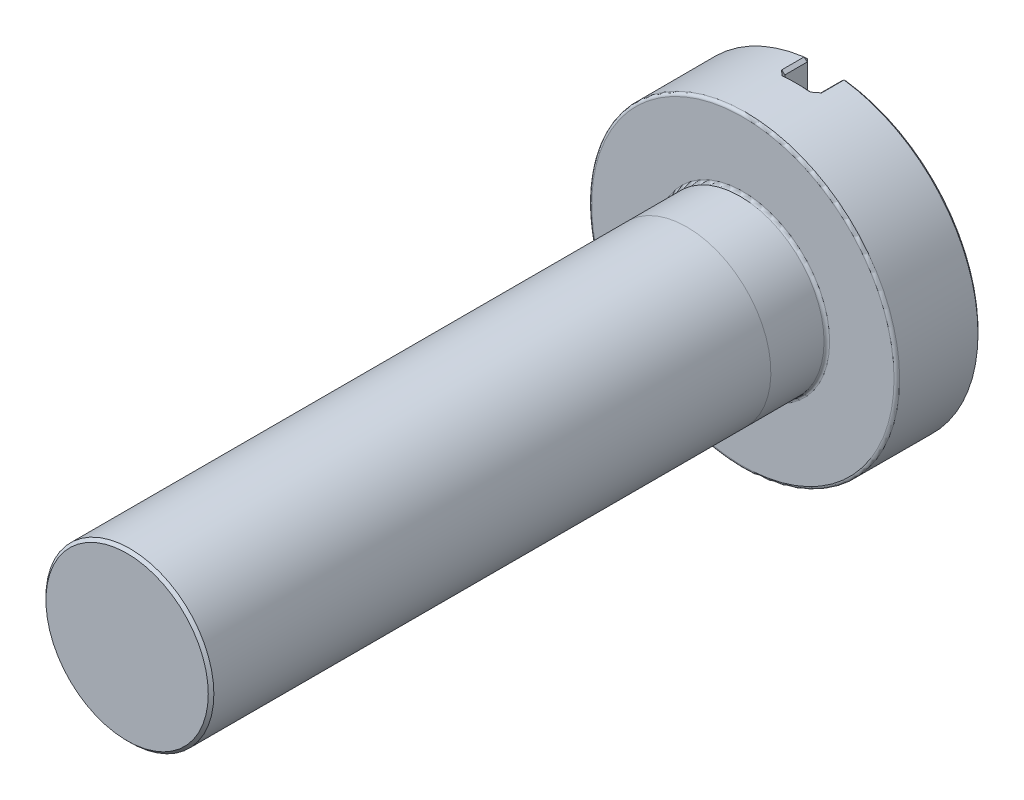
ISO-10303-21;
HEADER;
FILE_DESCRIPTION(('STEP AP214'),'2;1');
FILE_NAME('part.step','',(''),(''),'','','');
FILE_SCHEMA(('AUTOMOTIVE_DESIGN { 1 0 10303 214 1 1 1 1 }'));
ENDSEC;
DATA;
#1=APPLICATION_CONTEXT('core data for automotive mechanical design processes');
#2=APPLICATION_PROTOCOL_DEFINITION('international standard','automotive_design',2000,#1);
#3=PRODUCT_CONTEXT('',#1,'mechanical');
#4=PRODUCT('Part','Part','',(#3));
#5=PRODUCT_RELATED_PRODUCT_CATEGORY('part','',(#4));
#6=PRODUCT_DEFINITION_FORMATION('','',#4);
#7=PRODUCT_DEFINITION_CONTEXT('part definition',#1,'design');
#8=PRODUCT_DEFINITION('design','',#6,#7);
#9=PRODUCT_DEFINITION_SHAPE('','',#8);
#10=(LENGTH_UNIT() NAMED_UNIT(*) SI_UNIT(.MILLI.,.METRE.));
#11=(NAMED_UNIT(*) PLANE_ANGLE_UNIT() SI_UNIT($,.RADIAN.));
#12=(NAMED_UNIT(*) SI_UNIT($,.STERADIAN.) SOLID_ANGLE_UNIT());
#13=UNCERTAINTY_MEASURE_WITH_UNIT(LENGTH_MEASURE(1.E-05),#10,'distance_accuracy_value','');
#14=(GEOMETRIC_REPRESENTATION_CONTEXT(3) GLOBAL_UNCERTAINTY_ASSIGNED_CONTEXT((#13)) GLOBAL_UNIT_ASSIGNED_CONTEXT((#10,
#11,#12)) REPRESENTATION_CONTEXT('',''));
#15=CARTESIAN_POINT('',(0.,0.,0.));
#16=DIRECTION('',(0.,0.,1.));
#17=DIRECTION('',(1.,0.,0.));
#18=AXIS2_PLACEMENT_3D('',#15,#16,#17);
#19=CARTESIAN_POINT('',(0.,0.,11.));
#20=DIRECTION('',(0.,0.,-1.));
#21=DIRECTION('',(-1.,0.,0.));
#22=AXIS2_PLACEMENT_3D('',#19,#20,#21);
#23=CYLINDRICAL_SURFACE('',#22,1.5);
#24=CARTESIAN_POINT('',(0.,0.,10.95));
#25=DIRECTION('',(0.,0.,1.));
#26=DIRECTION('',(1.,0.,0.));
#27=AXIS2_PLACEMENT_3D('',#24,#25,#26);
#28=CIRCLE('',#27,1.5);
#29=CARTESIAN_POINT('',(1.5,0.,10.95));
#30=VERTEX_POINT('',#29);
#31=EDGE_CURVE('E46',#30,#30,#28,.F.);
#32=ORIENTED_EDGE('',*,*,#31,.T.);
#33=EDGE_LOOP('',(#32));
#34=FACE_BOUND('',#33,.T.);
#35=CARTESIAN_POINT('',(0.,0.,0.999999999999999));
#36=DIRECTION('',(0.,0.,-1.));
#37=DIRECTION('',(0.,1.,0.));
#38=AXIS2_PLACEMENT_3D('',#35,#36,#37);
#39=CIRCLE('',#38,1.5);
#40=CARTESIAN_POINT('',(0.,1.5,0.999999999999999));
#41=VERTEX_POINT('',#40);
#42=EDGE_CURVE('E11',#41,#41,#39,.T.);
#43=ORIENTED_EDGE('',*,*,#42,.F.);
#44=EDGE_LOOP('',(#43));
#45=FACE_BOUND('',#44,.T.);
#46=ADVANCED_FACE('F37',(#34,#45),#23,.T.);
#47=CARTESIAN_POINT('',(0.,0.,-1.5));
#48=DIRECTION('',(0.,0.,1.));
#49=DIRECTION('',(1.,0.,0.));
#50=AXIS2_PLACEMENT_3D('',#47,#48,#49);
#51=CYLINDRICAL_SURFACE('',#50,2.75);
#52=CARTESIAN_POINT('',(0.,0.,-0.0499999999999999));
#53=DIRECTION('',(0.,0.,1.));
#54=DIRECTION('',(1.,0.,0.));
#55=AXIS2_PLACEMENT_3D('',#52,#53,#54);
#56=CIRCLE('',#55,2.75);
#57=CARTESIAN_POINT('',(2.75,0.,-0.0499999999999999));
#58=VERTEX_POINT('',#57);
#59=EDGE_CURVE('E461',#58,#58,#56,.F.);
#60=ORIENTED_EDGE('',*,*,#59,.T.);
#61=EDGE_LOOP('',(#60));
#62=FACE_BOUND('',#61,.T.);
#63=CARTESIAN_POINT('',(-0.356481481481481,2.72679683023154,-1.05));
#64=CARTESIAN_POINT('',(-0.347664395842464,2.72794946380014,-1.04117807206455));
#65=CARTESIAN_POINT('',(-0.33882512364023,2.7290615860206,-1.03237298581949));
#66=CARTESIAN_POINT('',(-0.321099028338335,2.73120398569253,-1.01480079977808));
#67=CARTESIAN_POINT('',(-0.312212205212935,2.73223426309969,-1.0060337000023));
#68=CARTESIAN_POINT('',(-0.287162841256095,2.73501387422917,-0.981451563587695));
#69=CARTESIAN_POINT('',(-0.270942516358507,2.73666902458201,-0.965684718089823));
#70=CARTESIAN_POINT('',(-0.254629629631047,2.7381862156752,-0.950000000001396));
#71=B_SPLINE_CURVE_WITH_KNOTS('',3,(#63,#64,#65,#66,#67,#68,#69,#70),.UNSPECIFIED.,.F.,.F.,(4,2,
2,4),(0.,0.0375773794297736,0.0751547792021277,0.1431957218944),.UNSPECIFIED.);
#72=CARTESIAN_POINT('',(-0.356481481481481,2.72679683023154,-1.05));
#73=VERTEX_POINT('',#72);
#74=CARTESIAN_POINT('',(-0.254629629629628,2.73818621567538,-0.95));
#75=VERTEX_POINT('',#74);
#76=EDGE_CURVE('E250',#73,#75,#71,.T.);
#77=ORIENTED_EDGE('',*,*,#76,.F.);
#78=DIRECTION('',(0.,0.,1.));
#79=VECTOR('',#78,1.);
#80=CARTESIAN_POINT('',(-0.356481481481481,2.72679683023154,-1.5));
#81=LINE('',#80,#79);
#82=CARTESIAN_POINT('',(-0.356481481481481,2.72679683023154,-1.45));
#83=VERTEX_POINT('',#82);
#84=EDGE_CURVE('E248',#73,#83,#81,.F.);
#85=ORIENTED_EDGE('',*,*,#84,.T.);
#86=CARTESIAN_POINT('',(0.,0.,-1.45));
#87=DIRECTION('',(0.,0.,1.));
#88=DIRECTION('',(1.,0.,0.));
#89=AXIS2_PLACEMENT_3D('',#86,#87,#88);
#90=CIRCLE('',#89,2.75);
#91=CARTESIAN_POINT('',(-0.356481481481482,-2.72679683023154,-1.45));
#92=VERTEX_POINT('',#91);
#93=EDGE_CURVE('E243',#83,#92,#90,.T.);
#94=ORIENTED_EDGE('',*,*,#93,.T.);
#95=DIRECTION('',(0.,0.,1.));
#96=VECTOR('',#95,1.);
#97=CARTESIAN_POINT('',(-0.356481481481482,-2.72679683023154,-1.5));
#98=LINE('',#97,#96);
#99=CARTESIAN_POINT('',(-0.356481481481482,-2.72679683023154,-1.05));
#100=VERTEX_POINT('',#99);
#101=EDGE_CURVE('E241',#92,#100,#98,.T.);
#102=ORIENTED_EDGE('',*,*,#101,.T.);
#103=CARTESIAN_POINT('',(-0.254629629629629,-2.73818621567538,-0.95));
#104=CARTESIAN_POINT('',(-0.263638943794522,-2.73734837041018,-0.958661912495163));
#105=CARTESIAN_POINT('',(-0.272619899169563,-2.73646840241964,-0.967349125297718));
#106=CARTESIAN_POINT('',(-0.290528422567072,-2.73462508679492,-0.984769605017457));
#107=CARTESIAN_POINT('',(-0.299455990634111,-2.73366173923036,-0.993502871896181));
#108=CARTESIAN_POINT('',(-0.32447825011662,-2.73083811004549,-1.01810769091684));
#109=CARTESIAN_POINT('',(-0.340515929031501,-2.728883819563,-1.034026548804));
#110=CARTESIAN_POINT('',(-0.356481481481482,-2.72679683023154,-1.05));
#111=B_SPLINE_CURVE_WITH_KNOTS('',3,(#103,#104,#105,#106,#107,#108,#109,#110),.UNSPECIFIED.,.F.,
.F.,(4,2,2,4),(0.,0.0375774596881582,0.0751548880003334,0.14319579112404),.UNSPECIFIED.);
#112=CARTESIAN_POINT('',(-0.254629629629629,-2.73818621567538,-0.95));
#113=VERTEX_POINT('',#112);
#114=EDGE_CURVE('E234',#113,#100,#111,.T.);
#115=ORIENTED_EDGE('',*,*,#114,.F.);
#116=CARTESIAN_POINT('',(0.,0.,-0.95));
#117=DIRECTION('',(0.,0.,-1.));
#118=DIRECTION('',(-1.,0.,0.));
#119=AXIS2_PLACEMENT_3D('',#116,#117,#118);
#120=CIRCLE('',#119,2.75);
#121=CARTESIAN_POINT('',(0.254629629629627,-2.73818621567538,-0.95));
#122=VERTEX_POINT('',#121);
#123=EDGE_CURVE('E197',#113,#122,#120,.F.);
#124=ORIENTED_EDGE('',*,*,#123,.T.);
#125=CARTESIAN_POINT('',(0.356481481481481,-2.72679683023154,-1.05));
#126=CARTESIAN_POINT('',(0.347664395842463,-2.72794946380014,-1.04117807206455));
#127=CARTESIAN_POINT('',(0.338825123640229,-2.7290615860206,-1.03237298581949));
#128=CARTESIAN_POINT('',(0.321099028338334,-2.73120398569253,-1.01480079977808));
#129=CARTESIAN_POINT('',(0.312212205212934,-2.73223426309969,-1.0060337000023));
#130=CARTESIAN_POINT('',(0.287162841256095,-2.73501387422917,-0.981451563587695));
#131=CARTESIAN_POINT('',(0.270942516358507,-2.73666902458202,-0.965684718089822));
#132=CARTESIAN_POINT('',(0.254629629631046,-2.7381862156752,-0.950000000001396));
#133=B_SPLINE_CURVE_WITH_KNOTS('',3,(#125,#126,#127,#128,#129,#130,#131,#132),.UNSPECIFIED.,.F.,
.F.,(4,2,2,4),(0.,0.0375773794297739,0.0751547792021283,0.1431957218944),.UNSPECIFIED.);
#134=CARTESIAN_POINT('',(0.356481481481481,-2.72679683023154,-1.05));
#135=VERTEX_POINT('',#134);
#136=EDGE_CURVE('E188',#135,#122,#133,.T.);
#137=ORIENTED_EDGE('',*,*,#136,.F.);
#138=DIRECTION('',(0.,0.,1.));
#139=VECTOR('',#138,1.);
#140=CARTESIAN_POINT('',(0.35648148148148,-2.72679683023154,-1.5));
#141=LINE('',#140,#139);
#142=CARTESIAN_POINT('',(0.356481481481481,-2.72679683023154,-1.45));
#143=VERTEX_POINT('',#142);
#144=EDGE_CURVE('E186',#135,#143,#141,.F.);
#145=ORIENTED_EDGE('',*,*,#144,.T.);
#146=CARTESIAN_POINT('',(0.,0.,-1.45));
#147=DIRECTION('',(0.,0.,1.));
#148=DIRECTION('',(1.,0.,0.));
#149=AXIS2_PLACEMENT_3D('',#146,#147,#148);
#150=CIRCLE('',#149,2.75);
#151=CARTESIAN_POINT('',(0.356481481481483,2.72679683023154,-1.45));
#152=VERTEX_POINT('',#151);
#153=EDGE_CURVE('E182',#143,#152,#150,.T.);
#154=ORIENTED_EDGE('',*,*,#153,.T.);
#155=DIRECTION('',(0.,0.,1.));
#156=VECTOR('',#155,1.);
#157=CARTESIAN_POINT('',(0.356481481481483,2.72679683023154,-1.5));
#158=LINE('',#157,#156);
#159=CARTESIAN_POINT('',(0.356481481481483,2.72679683023154,-1.05));
#160=VERTEX_POINT('',#159);
#161=EDGE_CURVE('E184',#152,#160,#158,.T.);
#162=ORIENTED_EDGE('',*,*,#161,.T.);
#163=CARTESIAN_POINT('',(0.254629629629628,2.73818621567538,-0.95));
#164=CARTESIAN_POINT('',(0.263638943794522,2.73734837041018,-0.958661912495163));
#165=CARTESIAN_POINT('',(0.272619899169562,2.73646840241964,-0.967349125297718));
#166=CARTESIAN_POINT('',(0.290528422567072,2.73462508679492,-0.984769605017457));
#167=CARTESIAN_POINT('',(0.299455990634111,2.73366173923036,-0.99350287189618));
#168=CARTESIAN_POINT('',(0.32447825011662,2.73083811004549,-1.01810769091684));
#169=CARTESIAN_POINT('',(0.340515929031501,2.72888381956299,-1.034026548804));
#170=CARTESIAN_POINT('',(0.356481481481483,2.72679683023154,-1.05));
#171=B_SPLINE_CURVE_WITH_KNOTS('',3,(#163,#164,#165,#166,#167,#168,#169,#170),.UNSPECIFIED.,.F.,
.F.,(4,2,2,4),(0.,0.0375774596881585,0.075154888000334,0.143195791124041),.UNSPECIFIED.);
#172=CARTESIAN_POINT('',(0.254629629629628,2.73818621567538,-0.95));
#173=VERTEX_POINT('',#172);
#174=EDGE_CURVE('E227',#173,#160,#171,.T.);
#175=ORIENTED_EDGE('',*,*,#174,.F.);
#176=CARTESIAN_POINT('',(0.,0.,-0.95));
#177=DIRECTION('',(0.,0.,-1.));
#178=DIRECTION('',(-1.,0.,0.));
#179=AXIS2_PLACEMENT_3D('',#176,#177,#178);
#180=CIRCLE('',#179,2.75);
#181=EDGE_CURVE('E246',#173,#75,#180,.F.);
#182=ORIENTED_EDGE('',*,*,#181,.T.);
#183=EDGE_LOOP('',(#77,#85,#94,#102,#115,#124,#137,#145,#154,#162,#175,#182));
#184=FACE_BOUND('',#183,.T.);
#185=ADVANCED_FACE('F199',(#62,#184),#51,.T.);
#186=CARTESIAN_POINT('',(0.,0.,-1.5));
#187=DIRECTION('',(0.,0.,1.));
#188=DIRECTION('',(1.,0.,0.));
#189=AXIS2_PLACEMENT_3D('',#186,#187,#188);
#190=PLANE('',#189);
#191=CARTESIAN_POINT('',(0.,0.,-1.5));
#192=DIRECTION('',(0.,0.,1.));
#193=DIRECTION('',(1.,0.,0.));
#194=AXIS2_PLACEMENT_3D('',#191,#192,#193);
#195=CIRCLE('',#194,2.7);
#196=CARTESIAN_POINT('',(-0.350000000000001,-2.67721870604551,-1.5));
#197=VERTEX_POINT('',#196);
#198=CARTESIAN_POINT('',(-0.35,2.67721870604551,-1.5));
#199=VERTEX_POINT('',#198);
#200=EDGE_CURVE('E165',#197,#199,#195,.F.);
#201=ORIENTED_EDGE('',*,*,#200,.T.);
#202=DIRECTION('',(0.,-1.,0.));
#203=VECTOR('',#202,1.);
#204=CARTESIAN_POINT('',(-0.35,0.,-1.5));
#205=LINE('',#204,#203);
#206=EDGE_CURVE('E147',#199,#197,#205,.T.);
#207=ORIENTED_EDGE('',*,*,#206,.T.);
#208=EDGE_LOOP('',(#201,#207));
#209=FACE_BOUND('',#208,.T.);
#210=ADVANCED_FACE('F172',(#209),#190,.F.);
#211=ORIENTED_EDGE('',*,*,#42,.T.);
#212=EDGE_LOOP('',(#211));
#213=FACE_BOUND('',#212,.T.);
#214=CARTESIAN_POINT('',(0.,0.,0.0499999999999997));
#215=DIRECTION('',(0.,0.,1.));
#216=DIRECTION('',(1.,0.,0.));
#217=AXIS2_PLACEMENT_3D('',#214,#215,#216);
#218=CIRCLE('',#217,1.5);
#219=CARTESIAN_POINT('',(1.5,0.,0.0499999999999997));
#220=VERTEX_POINT('',#219);
#221=EDGE_CURVE('E459',#220,#220,#218,.T.);
#222=ORIENTED_EDGE('',*,*,#221,.T.);
#223=EDGE_LOOP('',(#222));
#224=FACE_BOUND('',#223,.T.);
#225=ADVANCED_FACE('F208',(#213,#224),#23,.T.);
#226=CARTESIAN_POINT('',(0.,0.,11.));
#227=DIRECTION('',(0.,0.,1.));
#228=DIRECTION('',(1.,0.,0.));
#229=AXIS2_PLACEMENT_3D('',#226,#227,#228);
#230=PLANE('',#229);
#231=CARTESIAN_POINT('',(0.,0.,11.));
#232=DIRECTION('',(0.,0.,1.));
#233=DIRECTION('',(1.,0.,0.));
#234=AXIS2_PLACEMENT_3D('',#231,#232,#233);
#235=CIRCLE('',#234,1.45);
#236=CARTESIAN_POINT('',(1.45,0.,11.));
#237=VERTEX_POINT('',#236);
#238=EDGE_CURVE('E460',#237,#237,#235,.T.);
#239=ORIENTED_EDGE('',*,*,#238,.T.);
#240=EDGE_LOOP('',(#239));
#241=FACE_BOUND('',#240,.T.);
#242=ADVANCED_FACE('F446',(#241),#230,.T.);
#243=CARTESIAN_POINT('',(0.,0.,-1.5));
#244=DIRECTION('',(0.,0.,1.));
#245=DIRECTION('',(1.,0.,0.));
#246=AXIS2_PLACEMENT_3D('',#243,#244,#245);
#247=CIRCLE('',#246,2.7);
#248=CARTESIAN_POINT('',(0.35,2.67721870604551,-1.5));
#249=VERTEX_POINT('',#248);
#250=CARTESIAN_POINT('',(0.349999999999999,-2.67721870604551,-1.5));
#251=VERTEX_POINT('',#250);
#252=EDGE_CURVE('E52',#249,#251,#247,.F.);
#253=ORIENTED_EDGE('',*,*,#252,.T.);
#254=DIRECTION('',(0.,1.,0.));
#255=VECTOR('',#254,1.);
#256=CARTESIAN_POINT('',(0.35,0.,-1.5));
#257=LINE('',#256,#255);
#258=EDGE_CURVE('E477',#251,#249,#257,.T.);
#259=ORIENTED_EDGE('',*,*,#258,.T.);
#260=EDGE_LOOP('',(#253,#259));
#261=FACE_BOUND('',#260,.T.);
#262=ADVANCED_FACE('F452',(#261),#190,.F.);
#263=CARTESIAN_POINT('',(0.,0.,0.));
#264=DIRECTION('',(0.,0.,1.));
#265=DIRECTION('',(1.,0.,0.));
#266=AXIS2_PLACEMENT_3D('',#263,#264,#265);
#267=PLANE('',#266);
#268=CARTESIAN_POINT('',(0.,0.,0.));
#269=DIRECTION('',(0.,0.,1.));
#270=DIRECTION('',(1.,0.,0.));
#271=AXIS2_PLACEMENT_3D('',#268,#269,#270);
#272=CIRCLE('',#271,2.7);
#273=CARTESIAN_POINT('',(2.7,0.,0.));
#274=VERTEX_POINT('',#273);
#275=EDGE_CURVE('E466',#274,#274,#272,.T.);
#276=ORIENTED_EDGE('',*,*,#275,.T.);
#277=EDGE_LOOP('',(#276));
#278=FACE_BOUND('',#277,.T.);
#279=CARTESIAN_POINT('',(0.,0.,0.));
#280=DIRECTION('',(0.,0.,1.));
#281=DIRECTION('',(1.,0.,0.));
#282=AXIS2_PLACEMENT_3D('',#279,#280,#281);
#283=CIRCLE('',#282,1.55);
#284=CARTESIAN_POINT('',(1.55,0.,0.));
#285=VERTEX_POINT('',#284);
#286=EDGE_CURVE('E474',#285,#285,#283,.F.);
#287=ORIENTED_EDGE('',*,*,#286,.T.);
#288=EDGE_LOOP('',(#287));
#289=FACE_BOUND('',#288,.T.);
#290=ADVANCED_FACE('F604',(#278,#289),#267,.T.);
#291=CARTESIAN_POINT('',(-0.299999999999999,11.0409396780184,-1.));
#292=DIRECTION('',(-1.,0.,0.));
#293=DIRECTION('',(0.,-1.,0.));
#294=AXIS2_PLACEMENT_3D('',#291,#292,#293);
#295=PLANE('',#294);
#296=DIRECTION('',(0.,0.,-1.));
#297=VECTOR('',#296,1.);
#298=CARTESIAN_POINT('',(-0.300000000000001,-2.67721870604551,-1.5));
#299=LINE('',#298,#297);
#300=CARTESIAN_POINT('',(-0.300000000000001,-2.67721870604551,-1.05));
#301=VERTEX_POINT('',#300);
#302=CARTESIAN_POINT('',(-0.300000000000001,-2.67721870604551,-1.45));
#303=VERTEX_POINT('',#302);
#304=EDGE_CURVE('E179',#301,#303,#299,.T.);
#305=ORIENTED_EDGE('',*,*,#304,.T.);
#306=DIRECTION('',(0.,1.,0.));
#307=VECTOR('',#306,1.);
#308=CARTESIAN_POINT('',(-0.299999999999999,11.0409396780184,-1.45));
#309=LINE('',#308,#307);
#310=CARTESIAN_POINT('',(-0.3,2.67721870604551,-1.45));
#311=VERTEX_POINT('',#310);
#312=EDGE_CURVE('E149',#303,#311,#309,.T.);
#313=ORIENTED_EDGE('',*,*,#312,.T.);
#314=DIRECTION('',(0.,0.,1.));
#315=VECTOR('',#314,1.);
#316=CARTESIAN_POINT('',(-0.3,2.67721870604551,-1.));
#317=LINE('',#316,#315);
#318=CARTESIAN_POINT('',(-0.3,2.67721870604551,-1.05));
#319=VERTEX_POINT('',#318);
#320=EDGE_CURVE('E175',#311,#319,#317,.T.);
#321=ORIENTED_EDGE('',*,*,#320,.T.);
#322=DIRECTION('',(0.,-1.,0.));
#323=VECTOR('',#322,1.);
#324=CARTESIAN_POINT('',(-0.299999999999999,11.0409396780184,-1.05));
#325=LINE('',#324,#323);
#326=EDGE_CURVE('E173',#319,#301,#325,.T.);
#327=ORIENTED_EDGE('',*,*,#326,.T.);
#328=EDGE_LOOP('',(#305,#313,#321,#327));
#329=FACE_BOUND('',#328,.T.);
#330=ADVANCED_FACE('F560',(#329),#295,.F.);
#331=CARTESIAN_POINT('',(0.300000000000001,11.0409396780184,-1.));
#332=DIRECTION('',(1.,0.,0.));
#333=DIRECTION('',(0.,1.,0.));
#334=AXIS2_PLACEMENT_3D('',#331,#332,#333);
#335=PLANE('',#334);
#336=DIRECTION('',(0.,0.,1.));
#337=VECTOR('',#336,1.);
#338=CARTESIAN_POINT('',(0.299999999999999,-2.67721870604551,-1.));
#339=LINE('',#338,#337);
#340=CARTESIAN_POINT('',(0.299999999999999,-2.67721870604551,-1.45));
#341=VERTEX_POINT('',#340);
#342=CARTESIAN_POINT('',(0.299999999999999,-2.67721870604551,-1.05));
#343=VERTEX_POINT('',#342);
#344=EDGE_CURVE('E496',#341,#343,#339,.T.);
#345=ORIENTED_EDGE('',*,*,#344,.T.);
#346=DIRECTION('',(0.,1.,0.));
#347=VECTOR('',#346,1.);
#348=CARTESIAN_POINT('',(0.300000000000001,11.0409396780184,-1.05));
#349=LINE('',#348,#347);
#350=CARTESIAN_POINT('',(0.3,2.67721870604551,-1.05));
#351=VERTEX_POINT('',#350);
#352=EDGE_CURVE('E525',#343,#351,#349,.T.);
#353=ORIENTED_EDGE('',*,*,#352,.T.);
#354=DIRECTION('',(0.,0.,-1.));
#355=VECTOR('',#354,1.);
#356=CARTESIAN_POINT('',(0.3,2.67721870604551,-1.5));
#357=LINE('',#356,#355);
#358=CARTESIAN_POINT('',(0.3,2.67721870604551,-1.45));
#359=VERTEX_POINT('',#358);
#360=EDGE_CURVE('E520',#351,#359,#357,.T.);
#361=ORIENTED_EDGE('',*,*,#360,.T.);
#362=DIRECTION('',(0.,-1.,0.));
#363=VECTOR('',#362,1.);
#364=CARTESIAN_POINT('',(0.300000000000001,11.0409396780184,-1.45));
#365=LINE('',#364,#363);
#366=EDGE_CURVE('E257',#359,#341,#365,.T.);
#367=ORIENTED_EDGE('',*,*,#366,.T.);
#368=EDGE_LOOP('',(#345,#353,#361,#367));
#369=FACE_BOUND('',#368,.T.);
#370=ADVANCED_FACE('F652',(#369),#335,.F.);
#371=CARTESIAN_POINT('',(0.,0.,-1.));
#372=DIRECTION('',(0.,0.,-1.));
#373=DIRECTION('',(-1.,0.,0.));
#374=AXIS2_PLACEMENT_3D('',#371,#372,#373);
#375=PLANE('',#374);
#376=DIRECTION('',(0.,-1.,0.));
#377=VECTOR('',#376,1.);
#378=CARTESIAN_POINT('',(0.249999999999998,0.,-1.));
#379=LINE('',#378,#377);
#380=CARTESIAN_POINT('',(0.249999999999998,2.68840101175401,-1.));
#381=VERTEX_POINT('',#380);
#382=CARTESIAN_POINT('',(0.249999999999998,-2.68840101175401,-1.));
#383=VERTEX_POINT('',#382);
#384=EDGE_CURVE('E526',#381,#383,#379,.T.);
#385=ORIENTED_EDGE('',*,*,#384,.T.);
#386=CARTESIAN_POINT('',(0.,0.,-1.));
#387=DIRECTION('',(0.,0.,-1.));
#388=DIRECTION('',(-1.,0.,0.));
#389=AXIS2_PLACEMENT_3D('',#386,#387,#388);
#390=CIRCLE('',#389,2.7);
#391=CARTESIAN_POINT('',(-0.249999999999999,-2.68840101175401,-1.));
#392=VERTEX_POINT('',#391);
#393=EDGE_CURVE('E511',#383,#392,#390,.T.);
#394=ORIENTED_EDGE('',*,*,#393,.T.);
#395=DIRECTION('',(0.,1.,0.));
#396=VECTOR('',#395,1.);
#397=CARTESIAN_POINT('',(-0.249999999999999,0.,-1.));
#398=LINE('',#397,#396);
#399=CARTESIAN_POINT('',(-0.249999999999999,2.68840101175401,-1.));
#400=VERTEX_POINT('',#399);
#401=EDGE_CURVE('E531',#392,#400,#398,.T.);
#402=ORIENTED_EDGE('',*,*,#401,.T.);
#403=CARTESIAN_POINT('',(0.,0.,-1.));
#404=DIRECTION('',(0.,0.,-1.));
#405=DIRECTION('',(-1.,0.,0.));
#406=AXIS2_PLACEMENT_3D('',#403,#404,#405);
#407=CIRCLE('',#406,2.7);
#408=EDGE_CURVE('E528',#400,#381,#407,.T.);
#409=ORIENTED_EDGE('',*,*,#408,.T.);
#410=EDGE_LOOP('',(#385,#394,#402,#409));
#411=FACE_BOUND('',#410,.T.);
#412=ADVANCED_FACE('F424',(#411),#375,.T.);
#413=CARTESIAN_POINT('',(0.,0.,-1.45));
#414=DIRECTION('',(0.,0.,1.));
#415=DIRECTION('',(1.,0.,0.));
#416=AXIS2_PLACEMENT_3D('',#413,#414,#415);
#417=CONICAL_SURFACE('',#416,2.75,0.785398163397457);
#418=DIRECTION('',(0.0916619901538044,-0.70114055620899,0.707106781186541));
#419=VECTOR('',#418,1.);
#420=CARTESIAN_POINT('',(0.,0.,-4.19999999999994));
#421=LINE('',#420,#419);
#422=EDGE_CURVE('E480',#251,#143,#421,.T.);
#423=ORIENTED_EDGE('',*,*,#422,.F.);
#424=ORIENTED_EDGE('',*,*,#252,.F.);
#425=DIRECTION('',(-0.0916619901538293,-0.701140556208987,-0.707106781186542));
#426=VECTOR('',#425,1.);
#427=CARTESIAN_POINT('',(0.,0.,-4.19999999999998));
#428=LINE('',#427,#426);
#429=EDGE_CURVE('E60',#152,#249,#428,.T.);
#430=ORIENTED_EDGE('',*,*,#429,.F.);
#431=ORIENTED_EDGE('',*,*,#153,.F.);
#432=EDGE_LOOP('',(#423,#424,#430,#431));
#433=FACE_BOUND('',#432,.T.);
#434=ADVANCED_FACE('F420',(#433),#417,.T.);
#435=CARTESIAN_POINT('',(0.35,0.,-1.5));
#436=DIRECTION('',(0.707106781186541,0.,0.707106781186554));
#437=DIRECTION('',(0.,1.,0.));
#438=AXIS2_PLACEMENT_3D('',#435,#436,#437);
#439=PLANE('',#438);
#440=DIRECTION('',(0.707106781186554,0.,-0.707106781186541));
#441=VECTOR('',#440,1.);
#442=CARTESIAN_POINT('',(0.3,2.67721870604551,-1.45));
#443=LINE('',#442,#441);
#444=EDGE_CURVE('E170',#249,#359,#443,.F.);
#445=ORIENTED_EDGE('',*,*,#444,.F.);
#446=ORIENTED_EDGE('',*,*,#258,.F.);
#447=DIRECTION('',(-0.707106781186554,0.,0.707106781186541));
#448=VECTOR('',#447,1.);
#449=CARTESIAN_POINT('',(0.328240740740741,-2.67721870604551,-1.47824074074074));
#450=LINE('',#449,#448);
#451=EDGE_CURVE('E483',#341,#251,#450,.F.);
#452=ORIENTED_EDGE('',*,*,#451,.F.);
#453=ORIENTED_EDGE('',*,*,#366,.F.);
#454=EDGE_LOOP('',(#445,#446,#452,#453));
#455=FACE_BOUND('',#454,.T.);
#456=ADVANCED_FACE('F417',(#455),#439,.F.);
#457=CARTESIAN_POINT('',(0.3,2.67721870604551,-1.45));
#458=DIRECTION('',(-0.550659428732137,0.627334350324276,-0.550659428732147));
#459=DIRECTION('',(0.,0.659685671502104,0.751541625470485));
#460=AXIS2_PLACEMENT_3D('',#457,#458,#459);
#461=PLANE('',#460);
#462=ORIENTED_EDGE('',*,*,#429,.T.);
#463=ORIENTED_EDGE('',*,*,#444,.T.);
#464=DIRECTION('',(0.75154162547049,0.659685671502097,0.));
#465=VECTOR('',#464,1.);
#466=CARTESIAN_POINT('',(0.3,2.67721870604551,-1.45));
#467=LINE('',#466,#465);
#468=EDGE_CURVE('E485',#152,#359,#467,.F.);
#469=ORIENTED_EDGE('',*,*,#468,.F.);
#470=EDGE_LOOP('',(#462,#463,#469));
#471=FACE_BOUND('',#470,.T.);
#472=ADVANCED_FACE('F413',(#471),#461,.T.);
#473=CARTESIAN_POINT('',(0.356481481481481,-2.72679683023154,-1.45));
#474=DIRECTION('',(-0.550659428732159,-0.627334350324257,-0.550659428732147));
#475=DIRECTION('',(0.751541625470467,-0.659685671502124,0.));
#476=AXIS2_PLACEMENT_3D('',#473,#474,#475);
#477=PLANE('',#476);
#478=ORIENTED_EDGE('',*,*,#451,.T.);
#479=ORIENTED_EDGE('',*,*,#422,.T.);
#480=DIRECTION('',(0.751541625470467,-0.659685671502124,0.));
#481=VECTOR('',#480,1.);
#482=CARTESIAN_POINT('',(0.356481481481481,-2.72679683023154,-1.45));
#483=LINE('',#482,#481);
#484=EDGE_CURVE('E379',#341,#143,#483,.T.);
#485=ORIENTED_EDGE('',*,*,#484,.F.);
#486=EDGE_LOOP('',(#478,#479,#485));
#487=FACE_BOUND('',#486,.T.);
#488=ADVANCED_FACE('F409',(#487),#477,.T.);
#489=CARTESIAN_POINT('',(0.3,2.67721870604551,-1.5));
#490=DIRECTION('',(-0.659685671502097,0.75154162547049,0.));
#491=DIRECTION('',(0.,0.,1.));
#492=AXIS2_PLACEMENT_3D('',#489,#490,#491);
#493=PLANE('',#492);
#494=ORIENTED_EDGE('',*,*,#468,.T.);
#495=ORIENTED_EDGE('',*,*,#360,.F.);
#496=DIRECTION('',(-0.75154162547049,-0.659685671502097,0.));
#497=VECTOR('',#496,1.);
#498=CARTESIAN_POINT('',(0.356481481481483,2.72679683023154,-1.05));
#499=LINE('',#498,#497);
#500=EDGE_CURVE('E380',#160,#351,#499,.T.);
#501=ORIENTED_EDGE('',*,*,#500,.F.);
#502=ORIENTED_EDGE('',*,*,#161,.F.);
#503=EDGE_LOOP('',(#494,#495,#501,#502));
#504=FACE_BOUND('',#503,.T.);
#505=ADVANCED_FACE('F405',(#504),#493,.T.);
#506=CARTESIAN_POINT('',(0.299999999999999,-2.67721870604551,-1.5));
#507=DIRECTION('',(0.659685671502124,0.751541625470467,0.));
#508=DIRECTION('',(0.,0.,1.));
#509=AXIS2_PLACEMENT_3D('',#506,#507,#508);
#510=PLANE('',#509);
#511=ORIENTED_EDGE('',*,*,#484,.T.);
#512=ORIENTED_EDGE('',*,*,#144,.F.);
#513=DIRECTION('',(0.751541625470467,-0.659685671502124,0.));
#514=VECTOR('',#513,1.);
#515=CARTESIAN_POINT('',(0.299999999999999,-2.67721870604551,-1.05));
#516=LINE('',#515,#514);
#517=EDGE_CURVE('E507',#343,#135,#516,.T.);
#518=ORIENTED_EDGE('',*,*,#517,.F.);
#519=ORIENTED_EDGE('',*,*,#344,.F.);
#520=EDGE_LOOP('',(#511,#512,#518,#519));
#521=FACE_BOUND('',#520,.T.);
#522=ADVANCED_FACE('F355',(#521),#510,.F.);
#523=CARTESIAN_POINT('',(0.249999999999998,0.,-1.));
#524=DIRECTION('',(0.707106781186535,0.,0.70710678118656));
#525=DIRECTION('',(0.,-1.,0.));
#526=AXIS2_PLACEMENT_3D('',#523,#524,#525);
#527=PLANE('',#526);
#528=CARTESIAN_POINT('',(0.3,2.67721870604551,-1.05));
#529=CARTESIAN_POINT('',(0.295625856762104,2.67819696618349,-1.0456258567621));
#530=CARTESIAN_POINT('',(0.291251713524209,2.67917522632147,-1.04125171352421));
#531=CARTESIAN_POINT('',(0.282503427048418,2.68113174659742,-1.03250342704842));
#532=CARTESIAN_POINT('',(0.278129283810523,2.6821100067354,-1.02812928381052));
#533=CARTESIAN_POINT('',(0.265836760381751,2.68485918183359,-1.01583676038175));
#534=CARTESIAN_POINT('',(0.257918380190875,2.6866300967938,-1.00791838019088));
#535=CARTESIAN_POINT('',(0.249999999999998,2.68840101175401,-1.));
#536=B_SPLINE_CURVE_WITH_KNOTS('',3,(#528,#529,#530,#531,#532,#533,#534,#535),.UNSPECIFIED.,.F.,
.F.,(4,2,2,4),(0.,0.0187885406367622,0.0375770812735245,0.0715894123523757),.UNSPECIFIED.);
#537=EDGE_CURVE('E370',#351,#381,#536,.T.);
#538=ORIENTED_EDGE('',*,*,#537,.F.);
#539=ORIENTED_EDGE('',*,*,#352,.F.);
#540=CARTESIAN_POINT('',(0.249999999999998,-2.68840101175401,-1.));
#541=CARTESIAN_POINT('',(0.254374143237893,-2.68742275161603,-1.0043741432379));
#542=CARTESIAN_POINT('',(0.258748286475788,-2.68644449147805,-1.00874828647579));
#543=CARTESIAN_POINT('',(0.267496572951579,-2.6844879712021,-1.01749657295158));
#544=CARTESIAN_POINT('',(0.271870716189475,-2.68350971106412,-1.02187071618948));
#545=CARTESIAN_POINT('',(0.284163239618246,-2.68076053596593,-1.03416323961825));
#546=CARTESIAN_POINT('',(0.292081619809123,-2.67898962100572,-1.04208161980912));
#547=CARTESIAN_POINT('',(0.299999999999999,-2.67721870604551,-1.05));
#548=B_SPLINE_CURVE_WITH_KNOTS('',3,(#540,#541,#542,#543,#544,#545,#546,#547),.UNSPECIFIED.,.F.,
.F.,(4,2,2,4),(0.,0.0187885406367623,0.0375770812735247,0.071589412352376),.UNSPECIFIED.);
#549=EDGE_CURVE('E363',#383,#343,#548,.T.);
#550=ORIENTED_EDGE('',*,*,#549,.F.);
#551=ORIENTED_EDGE('',*,*,#384,.F.);
#552=EDGE_LOOP('',(#538,#539,#550,#551));
#553=FACE_BOUND('',#552,.T.);
#554=ADVANCED_FACE('F350',(#553),#527,.F.);
#555=CARTESIAN_POINT('',(0.249999999999998,2.68840101175401,-1.));
#556=CARTESIAN_POINT('',(0.3,2.67721870604551,-1.05));
#557=CARTESIAN_POINT('',(0.254629629629628,2.73818621567538,-0.95));
#558=CARTESIAN_POINT('',(0.356481481481483,2.72679683023154,-1.05));
#559=CARTESIAN_POINT('',(0.254700493957951,2.73894826260323,-0.949234665254114));
#560=CARTESIAN_POINT('',(0.357346026287021,2.72755570745305,-1.05));
#561=B_SPLINE_SURFACE_WITH_KNOTS('',1,1,((#555,#556),(#557,#558),(#559,#560)),.UNSPECIFIED.,.F.,
.F.,.F.,(2,1,2),(2,2),(0.,1.,1.01530669491773),(0.,1.),.UNSPECIFIED.);
#562=DIRECTION('',(0.0654728501098666,0.704069105911138,0.707106781186535));
#563=VECTOR('',#562,1.);
#564=CARTESIAN_POINT('',(0.249999999999998,2.68840101175401,-1.));
#565=LINE('',#564,#563);
#566=EDGE_CURVE('E512',#173,#381,#565,.F.);
#567=ORIENTED_EDGE('',*,*,#500,.T.);
#568=ORIENTED_EDGE('',*,*,#537,.T.);
#569=ORIENTED_EDGE('',*,*,#566,.F.);
#570=ORIENTED_EDGE('',*,*,#174,.T.);
#571=EDGE_LOOP('',(#567,#568,#569,#570));
#572=FACE_BOUND('',#571,.T.);
#573=ADVANCED_FACE('F354',(#572),#561,.T.);
#574=CARTESIAN_POINT('',(0.299999999999999,-2.67721870604551,-1.05));
#575=CARTESIAN_POINT('',(0.249999999999998,-2.68840101175401,-1.));
#576=CARTESIAN_POINT('',(0.356481481481481,-2.72679683023154,-1.05));
#577=CARTESIAN_POINT('',(0.254629629629627,-2.73818621567538,-0.95));
#578=CARTESIAN_POINT('',(0.35733822885105,-2.72754886304602,-1.05));
#579=CARTESIAN_POINT('',(0.254699854823854,-2.73894138960823,-0.949241567902349));
#580=B_SPLINE_SURFACE_WITH_KNOTS('',1,1,((#574,#575),(#576,#577),(#578,#579)),.UNSPECIFIED.,.F.,
.F.,.F.,(2,1,2),(2,2),(0.,1.,1.01516864195303),(0.,1.),.UNSPECIFIED.);
#581=DIRECTION('',(-0.0654728501098659,0.704069105911138,-0.707106781186535));
#582=VECTOR('',#581,1.);
#583=CARTESIAN_POINT('',(0.254629629629627,-2.73818621567538,-0.95));
#584=LINE('',#583,#582);
#585=EDGE_CURVE('E318',#383,#122,#584,.F.);
#586=ORIENTED_EDGE('',*,*,#517,.T.);
#587=ORIENTED_EDGE('',*,*,#136,.T.);
#588=ORIENTED_EDGE('',*,*,#585,.F.);
#589=ORIENTED_EDGE('',*,*,#549,.T.);
#590=EDGE_LOOP('',(#586,#587,#588,#589));
#591=FACE_BOUND('',#590,.T.);
#592=ADVANCED_FACE('F348',(#591),#580,.T.);
#593=CARTESIAN_POINT('',(0.,0.,-0.95));
#594=DIRECTION('',(0.,0.,1.));
#595=DIRECTION('',(1.,0.,0.));
#596=AXIS2_PLACEMENT_3D('',#593,#594,#595);
#597=CONICAL_SURFACE('',#596,2.75,0.785398163397466);
#598=ORIENTED_EDGE('',*,*,#566,.T.);
#599=ORIENTED_EDGE('',*,*,#408,.F.);
#600=DIRECTION('',(0.0654728501098666,-0.704069105911138,-0.707106781186535));
#601=VECTOR('',#600,1.);
#602=CARTESIAN_POINT('',(-0.254629629629628,2.73818621567538,-0.95));
#603=LINE('',#602,#601);
#604=EDGE_CURVE('E319',#75,#400,#603,.T.);
#605=ORIENTED_EDGE('',*,*,#604,.F.);
#606=ORIENTED_EDGE('',*,*,#181,.F.);
#607=EDGE_LOOP('',(#598,#599,#605,#606));
#608=FACE_BOUND('',#607,.T.);
#609=ADVANCED_FACE('F344',(#608),#597,.T.);
#610=CARTESIAN_POINT('',(0.,0.,-0.95));
#611=DIRECTION('',(0.,0.,1.));
#612=DIRECTION('',(1.,0.,0.));
#613=AXIS2_PLACEMENT_3D('',#610,#611,#612);
#614=CONICAL_SURFACE('',#613,2.75,0.785398163397466);
#615=ORIENTED_EDGE('',*,*,#585,.T.);
#616=ORIENTED_EDGE('',*,*,#123,.F.);
#617=DIRECTION('',(-0.0654728501098666,-0.704069105911138,0.707106781186535));
#618=VECTOR('',#617,1.);
#619=CARTESIAN_POINT('',(-0.249999999999999,-2.68840101175401,-1.));
#620=LINE('',#619,#618);
#621=EDGE_CURVE('E550',#392,#113,#620,.T.);
#622=ORIENTED_EDGE('',*,*,#621,.F.);
#623=ORIENTED_EDGE('',*,*,#393,.F.);
#624=EDGE_LOOP('',(#615,#616,#622,#623));
#625=FACE_BOUND('',#624,.T.);
#626=ADVANCED_FACE('F293',(#625),#614,.T.);
#627=CARTESIAN_POINT('',(-0.249999999999999,0.,-1.));
#628=DIRECTION('',(-0.707106781186535,0.,0.70710678118656));
#629=DIRECTION('',(0.,1.,0.));
#630=AXIS2_PLACEMENT_3D('',#627,#628,#629);
#631=PLANE('',#630);
#632=CARTESIAN_POINT('',(-0.249999999999999,2.68840101175401,-1.));
#633=CARTESIAN_POINT('',(-0.254374143237894,2.68742275161603,-1.0043741432379));
#634=CARTESIAN_POINT('',(-0.258748286475789,2.68644449147805,-1.00874828647579));
#635=CARTESIAN_POINT('',(-0.26749657295158,2.6844879712021,-1.01749657295158));
#636=CARTESIAN_POINT('',(-0.271870716189475,2.68350971106412,-1.02187071618948));
#637=CARTESIAN_POINT('',(-0.284163239618247,2.68076053596593,-1.03416323961825));
#638=CARTESIAN_POINT('',(-0.292081619809124,2.67898962100572,-1.04208161980912));
#639=CARTESIAN_POINT('',(-0.3,2.67721870604551,-1.05));
#640=B_SPLINE_CURVE_WITH_KNOTS('',3,(#632,#633,#634,#635,#636,#637,#638,#639),.UNSPECIFIED.,.F.,
.F.,(4,2,2,4),(0.,0.0187885406367623,0.0375770812735245,0.0715894123523758),.UNSPECIFIED.);
#641=EDGE_CURVE('E309',#400,#319,#640,.T.);
#642=ORIENTED_EDGE('',*,*,#641,.F.);
#643=ORIENTED_EDGE('',*,*,#401,.F.);
#644=CARTESIAN_POINT('',(-0.300000000000001,-2.67721870604551,-1.05));
#645=CARTESIAN_POINT('',(-0.295625856762105,-2.67819696618349,-1.0456258567621));
#646=CARTESIAN_POINT('',(-0.29125171352421,-2.67917522632147,-1.04125171352421));
#647=CARTESIAN_POINT('',(-0.282503427048419,-2.68113174659742,-1.03250342704842));
#648=CARTESIAN_POINT('',(-0.278129283810524,-2.6821100067354,-1.02812928381052));
#649=CARTESIAN_POINT('',(-0.265836760381752,-2.68485918183359,-1.01583676038175));
#650=CARTESIAN_POINT('',(-0.257918380190876,-2.6866300967938,-1.00791838019088));
#651=CARTESIAN_POINT('',(-0.249999999999999,-2.68840101175401,-1.));
#652=B_SPLINE_CURVE_WITH_KNOTS('',3,(#644,#645,#646,#647,#648,#649,#650,#651),.UNSPECIFIED.,.F.,
.F.,(4,2,2,4),(0.,0.0187885406367622,0.0375770812735245,0.0715894123523758),.UNSPECIFIED.);
#653=EDGE_CURVE('E301',#301,#392,#652,.T.);
#654=ORIENTED_EDGE('',*,*,#653,.F.);
#655=ORIENTED_EDGE('',*,*,#326,.F.);
#656=EDGE_LOOP('',(#642,#643,#654,#655));
#657=FACE_BOUND('',#656,.T.);
#658=ADVANCED_FACE('F288',(#657),#631,.F.);
#659=CARTESIAN_POINT('',(-0.3,2.67721870604551,-1.05));
#660=CARTESIAN_POINT('',(-0.249999999999999,2.68840101175401,-1.));
#661=CARTESIAN_POINT('',(-0.356481481481481,2.72679683023154,-1.05));
#662=CARTESIAN_POINT('',(-0.254629629629628,2.73818621567538,-0.95));
#663=CARTESIAN_POINT('',(-0.35733822885105,2.72754886304602,-1.05));
#664=CARTESIAN_POINT('',(-0.254699854823855,2.73894138960823,-0.949241567902349));
#665=B_SPLINE_SURFACE_WITH_KNOTS('',1,1,((#659,#660),(#661,#662),(#663,#664)),.UNSPECIFIED.,.F.,
.F.,.F.,(2,1,2),(2,2),(0.,1.,1.01516864195302),(0.,1.),.UNSPECIFIED.);
#666=DIRECTION('',(-0.751541625470473,0.659685671502118,0.));
#667=VECTOR('',#666,1.);
#668=CARTESIAN_POINT('',(-0.3,2.67721870604551,-1.05));
#669=LINE('',#668,#667);
#670=EDGE_CURVE('E545',#73,#319,#669,.F.);
#671=ORIENTED_EDGE('',*,*,#604,.T.);
#672=ORIENTED_EDGE('',*,*,#641,.T.);
#673=ORIENTED_EDGE('',*,*,#670,.F.);
#674=ORIENTED_EDGE('',*,*,#76,.T.);
#675=EDGE_LOOP('',(#671,#672,#673,#674));
#676=FACE_BOUND('',#675,.T.);
#677=ADVANCED_FACE('F292',(#676),#665,.T.);
#678=CARTESIAN_POINT('',(-0.249999999999999,-2.68840101175401,-1.));
#679=CARTESIAN_POINT('',(-0.300000000000001,-2.67721870604551,-1.05));
#680=CARTESIAN_POINT('',(-0.254629629629629,-2.73818621567538,-0.95));
#681=CARTESIAN_POINT('',(-0.356481481481482,-2.72679683023154,-1.05));
#682=CARTESIAN_POINT('',(-0.254700493957952,-2.73894826260323,-0.949234665254114));
#683=CARTESIAN_POINT('',(-0.357346026287021,-2.72755570745305,-1.05));
#684=B_SPLINE_SURFACE_WITH_KNOTS('',1,1,((#678,#679),(#680,#681),(#682,#683)),.UNSPECIFIED.,.F.,
.F.,.F.,(2,1,2),(2,2),(0.,1.,1.01530669491773),(0.,1.),.UNSPECIFIED.);
#685=DIRECTION('',(0.751541625470475,0.659685671502115,0.));
#686=VECTOR('',#685,1.);
#687=CARTESIAN_POINT('',(-0.356481481481482,-2.72679683023154,-1.05));
#688=LINE('',#687,#686);
#689=EDGE_CURVE('E543',#301,#100,#688,.F.);
#690=ORIENTED_EDGE('',*,*,#621,.T.);
#691=ORIENTED_EDGE('',*,*,#114,.T.);
#692=ORIENTED_EDGE('',*,*,#689,.F.);
#693=ORIENTED_EDGE('',*,*,#653,.T.);
#694=EDGE_LOOP('',(#690,#691,#692,#693));
#695=FACE_BOUND('',#694,.T.);
#696=ADVANCED_FACE('F286',(#695),#684,.T.);
#697=CARTESIAN_POINT('',(-0.3,2.67721870604551,-1.5));
#698=DIRECTION('',(-0.659685671502117,-0.751541625470473,0.));
#699=DIRECTION('',(0.,0.,1.));
#700=AXIS2_PLACEMENT_3D('',#697,#698,#699);
#701=PLANE('',#700);
#702=ORIENTED_EDGE('',*,*,#670,.T.);
#703=ORIENTED_EDGE('',*,*,#320,.F.);
#704=DIRECTION('',(-0.751541625470473,0.659685671502117,0.));
#705=VECTOR('',#704,1.);
#706=CARTESIAN_POINT('',(-0.3,2.67721870604551,-1.45));
#707=LINE('',#706,#705);
#708=EDGE_CURVE('E540',#83,#311,#707,.F.);
#709=ORIENTED_EDGE('',*,*,#708,.F.);
#710=ORIENTED_EDGE('',*,*,#84,.F.);
#711=EDGE_LOOP('',(#702,#703,#709,#710));
#712=FACE_BOUND('',#711,.T.);
#713=ADVANCED_FACE('F283',(#712),#701,.F.);
#714=CARTESIAN_POINT('',(0.,0.,-1.45));
#715=DIRECTION('',(0.,0.,1.));
#716=DIRECTION('',(1.,0.,0.));
#717=AXIS2_PLACEMENT_3D('',#714,#715,#716);
#718=CONICAL_SURFACE('',#717,2.75,0.785398163397457);
#719=DIRECTION('',(0.0916619901538097,0.70114055620899,-0.707106781186542));
#720=VECTOR('',#719,1.);
#721=CARTESIAN_POINT('',(0.,0.,-4.19999999999995));
#722=LINE('',#721,#720);
#723=EDGE_CURVE('E154',#92,#197,#722,.T.);
#724=ORIENTED_EDGE('',*,*,#723,.F.);
#725=ORIENTED_EDGE('',*,*,#93,.F.);
#726=DIRECTION('',(-0.0916619901538038,0.70114055620899,0.707106781186541));
#727=VECTOR('',#726,1.);
#728=CARTESIAN_POINT('',(0.,0.,-4.19999999999994));
#729=LINE('',#728,#727);
#730=EDGE_CURVE('E162',#199,#83,#729,.T.);
#731=ORIENTED_EDGE('',*,*,#730,.F.);
#732=ORIENTED_EDGE('',*,*,#200,.F.);
#733=EDGE_LOOP('',(#724,#725,#731,#732));
#734=FACE_BOUND('',#733,.T.);
#735=ADVANCED_FACE('F166',(#734),#718,.T.);
#736=CARTESIAN_POINT('',(-0.300000000000001,-2.67721870604551,-1.5));
#737=DIRECTION('',(0.659685671502117,-0.751541625470473,0.));
#738=DIRECTION('',(0.,0.,1.));
#739=AXIS2_PLACEMENT_3D('',#736,#737,#738);
#740=PLANE('',#739);
#741=ORIENTED_EDGE('',*,*,#689,.T.);
#742=ORIENTED_EDGE('',*,*,#101,.F.);
#743=DIRECTION('',(-0.751541625470473,-0.659685671502117,0.));
#744=VECTOR('',#743,1.);
#745=CARTESIAN_POINT('',(-0.328240740740741,-2.70200776813852,-1.45));
#746=LINE('',#745,#744);
#747=EDGE_CURVE('E158',#303,#92,#746,.T.);
#748=ORIENTED_EDGE('',*,*,#747,.F.);
#749=ORIENTED_EDGE('',*,*,#304,.F.);
#750=EDGE_LOOP('',(#741,#742,#748,#749));
#751=FACE_BOUND('',#750,.T.);
#752=ADVANCED_FACE('F276',(#751),#740,.T.);
#753=CARTESIAN_POINT('',(-0.3,2.67721870604551,-1.45));
#754=DIRECTION('',(0.550659428732152,0.627334350324259,-0.550659428732151));
#755=DIRECTION('',(-0.751541625470473,0.659685671502118,0.));
#756=AXIS2_PLACEMENT_3D('',#753,#754,#755);
#757=PLANE('',#756);
#758=ORIENTED_EDGE('',*,*,#730,.T.);
#759=ORIENTED_EDGE('',*,*,#708,.T.);
#760=DIRECTION('',(0.707106781186554,0.,0.707106781186541));
#761=VECTOR('',#760,1.);
#762=CARTESIAN_POINT('',(-0.3,2.67721870604551,-1.45));
#763=LINE('',#762,#761);
#764=EDGE_CURVE('E151',#199,#311,#763,.T.);
#765=ORIENTED_EDGE('',*,*,#764,.F.);
#766=EDGE_LOOP('',(#758,#759,#765));
#767=FACE_BOUND('',#766,.T.);
#768=ADVANCED_FACE('F273',(#767),#757,.T.);
#769=CARTESIAN_POINT('',(-0.350000000000001,-2.67721870604551,-1.5));
#770=DIRECTION('',(0.550659428732151,-0.627334350324263,-0.550659428732149));
#771=DIRECTION('',(0.751541625470475,0.659685671502115,0.));
#772=AXIS2_PLACEMENT_3D('',#769,#770,#771);
#773=PLANE('',#772);
#774=ORIENTED_EDGE('',*,*,#747,.T.);
#775=ORIENTED_EDGE('',*,*,#723,.T.);
#776=DIRECTION('',(-0.707106781186554,0.,-0.707106781186541));
#777=VECTOR('',#776,1.);
#778=CARTESIAN_POINT('',(-0.350000000000001,-2.67721870604551,-1.5));
#779=LINE('',#778,#777);
#780=EDGE_CURVE('E143',#303,#197,#779,.T.);
#781=ORIENTED_EDGE('',*,*,#780,.F.);
#782=EDGE_LOOP('',(#774,#775,#781));
#783=FACE_BOUND('',#782,.T.);
#784=ADVANCED_FACE('F156',(#783),#773,.T.);
#785=CARTESIAN_POINT('',(-0.35,0.,-1.5));
#786=DIRECTION('',(-0.707106781186541,0.,0.707106781186554));
#787=DIRECTION('',(0.,-1.,0.));
#788=AXIS2_PLACEMENT_3D('',#785,#786,#787);
#789=PLANE('',#788);
#790=ORIENTED_EDGE('',*,*,#764,.T.);
#791=ORIENTED_EDGE('',*,*,#312,.F.);
#792=ORIENTED_EDGE('',*,*,#780,.T.);
#793=ORIENTED_EDGE('',*,*,#206,.F.);
#794=EDGE_LOOP('',(#790,#791,#792,#793));
#795=FACE_BOUND('',#794,.T.);
#796=ADVANCED_FACE('F145',(#795),#789,.F.);
#797=CARTESIAN_POINT('',(0.,0.,-0.0499999999999999));
#798=DIRECTION('',(0.,0.,1.));
#799=DIRECTION('',(1.,0.,0.));
#800=AXIS2_PLACEMENT_3D('',#797,#798,#799);
#801=TOROIDAL_SURFACE('',#800,2.7,0.05);
#802=ORIENTED_EDGE('',*,*,#59,.F.);
#803=EDGE_LOOP('',(#802));
#804=FACE_BOUND('',#803,.T.);
#805=ORIENTED_EDGE('',*,*,#275,.F.);
#806=EDGE_LOOP('',(#805));
#807=FACE_BOUND('',#806,.T.);
#808=ADVANCED_FACE('F270',(#804,#807),#801,.T.);
#809=CARTESIAN_POINT('',(0.,0.,0.0499999999999997));
#810=DIRECTION('',(0.,0.,1.));
#811=DIRECTION('',(1.,0.,0.));
#812=AXIS2_PLACEMENT_3D('',#809,#810,#811);
#813=TOROIDAL_SURFACE('',#812,1.55,0.05);
#814=ORIENTED_EDGE('',*,*,#286,.F.);
#815=EDGE_LOOP('',(#814));
#816=FACE_BOUND('',#815,.T.);
#817=ORIENTED_EDGE('',*,*,#221,.F.);
#818=EDGE_LOOP('',(#817));
#819=FACE_BOUND('',#818,.T.);
#820=ADVANCED_FACE('F427',(#816,#819),#813,.F.);
#821=CARTESIAN_POINT('',(0.,0.,11.));
#822=DIRECTION('',(0.,0.,-1.));
#823=DIRECTION('',(-1.,0.,0.));
#824=AXIS2_PLACEMENT_3D('',#821,#822,#823);
#825=CONICAL_SURFACE('',#824,1.45,0.78539816339744);
#826=ORIENTED_EDGE('',*,*,#31,.F.);
#827=EDGE_LOOP('',(#826));
#828=FACE_BOUND('',#827,.T.);
#829=ORIENTED_EDGE('',*,*,#238,.F.);
#830=EDGE_LOOP('',(#829));
#831=FACE_BOUND('',#830,.T.);
#832=ADVANCED_FACE('F39',(#828,#831),#825,.T.);
#833=CLOSED_SHELL('',(#46,#185,#210,#225,#242,#262,#290,#330,#370,#412,#434,#456,#472,#488,#505,
#522,#554,#573,#592,#609,#626,#658,#677,#696,#713,#735,#752,#768,#784,#796,#808,#820,#832));
#834=MANIFOLD_SOLID_BREP('B2',#833);
#835=ADVANCED_BREP_SHAPE_REPRESENTATION('',(#18,#834),#14);
#836=SHAPE_DEFINITION_REPRESENTATION(#9,#835);
ENDSEC;
END-ISO-10303-21;
